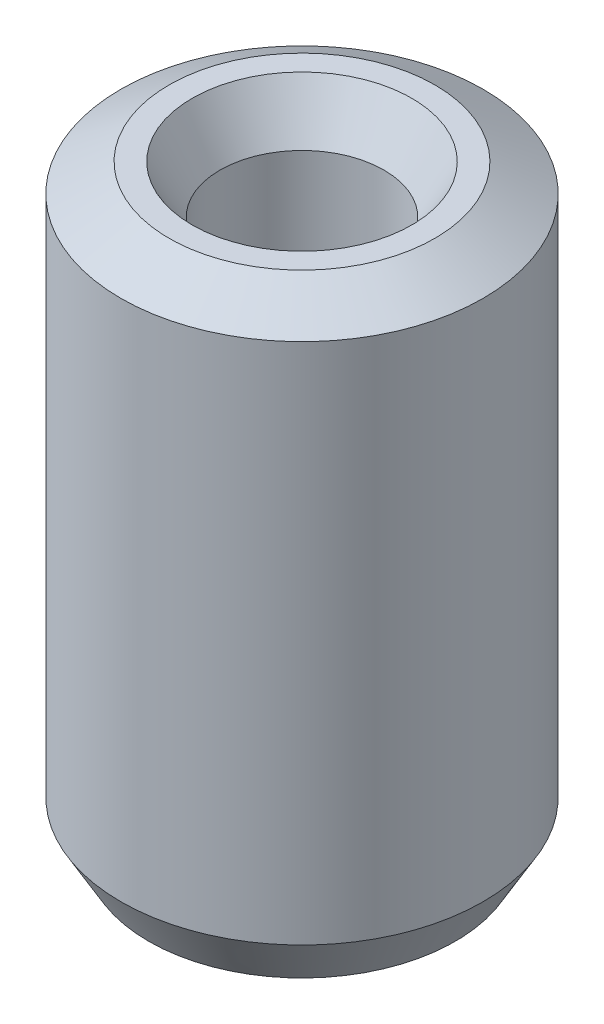
ISO-10303-21;
HEADER;
FILE_DESCRIPTION(('STEP AP214'),'2;1');
FILE_NAME('part.step','',(''),(''),'','','');
FILE_SCHEMA(('AUTOMOTIVE_DESIGN { 1 0 10303 214 1 1 1 1 }'));
ENDSEC;
DATA;
#1=APPLICATION_CONTEXT('core data for automotive mechanical design processes');
#2=APPLICATION_PROTOCOL_DEFINITION('international standard','automotive_design',2000,#1);
#3=PRODUCT_CONTEXT('',#1,'mechanical');
#4=PRODUCT('Part','Part','',(#3));
#5=PRODUCT_RELATED_PRODUCT_CATEGORY('part','',(#4));
#6=PRODUCT_DEFINITION_FORMATION('','',#4);
#7=PRODUCT_DEFINITION_CONTEXT('part definition',#1,'design');
#8=PRODUCT_DEFINITION('design','',#6,#7);
#9=PRODUCT_DEFINITION_SHAPE('','',#8);
#10=(LENGTH_UNIT() NAMED_UNIT(*) SI_UNIT(.MILLI.,.METRE.));
#11=(NAMED_UNIT(*) PLANE_ANGLE_UNIT() SI_UNIT($,.RADIAN.));
#12=(NAMED_UNIT(*) SI_UNIT($,.STERADIAN.) SOLID_ANGLE_UNIT());
#13=UNCERTAINTY_MEASURE_WITH_UNIT(LENGTH_MEASURE(1.E-05),#10,'distance_accuracy_value','');
#14=(GEOMETRIC_REPRESENTATION_CONTEXT(3) GLOBAL_UNCERTAINTY_ASSIGNED_CONTEXT((#13)) GLOBAL_UNIT_ASSIGNED_CONTEXT((#10,
#11,#12)) REPRESENTATION_CONTEXT('',''));
#15=CARTESIAN_POINT('',(0.,0.,0.));
#16=DIRECTION('',(0.,0.,1.));
#17=DIRECTION('',(1.,0.,0.));
#18=AXIS2_PLACEMENT_3D('',#15,#16,#17);
#19=CARTESIAN_POINT('',(0.,57.8312941329727,0.));
#20=DIRECTION('',(0.,-1.,0.));
#21=DIRECTION('',(0.,0.,-1.));
#22=AXIS2_PLACEMENT_3D('',#19,#20,#21);
#23=CYLINDRICAL_SURFACE('',#22,17.5);
#24=CARTESIAN_POINT('',(0.,4.65961195969248,0.));
#25=DIRECTION('',(0.,1.,0.));
#26=DIRECTION('',(0.,0.,1.));
#27=AXIS2_PLACEMENT_3D('',#24,#25,#26);
#28=CIRCLE('',#27,17.5);
#29=CARTESIAN_POINT('',(0.,4.65961195969247,-17.5));
#30=VERTEX_POINT('',#29);
#31=EDGE_CURVE('E10',#30,#30,#28,.T.);
#32=CARTESIAN_POINT('',(0.,55.1410659137251,0.));
#33=DIRECTION('',(0.,1.,0.));
#34=DIRECTION('',(0.,0.,1.));
#35=AXIS2_PLACEMENT_3D('',#32,#33,#34);
#36=CIRCLE('',#35,17.5);
#37=CARTESIAN_POINT('',(0.,55.1410659137251,-17.5));
#38=VERTEX_POINT('',#37);
#39=EDGE_CURVE('E50',#38,#38,#36,.F.);
#40=CARTESIAN_POINT('',(0.,4.65961195969247,-17.5));
#41=CARTESIAN_POINT('',(0.,5.18546043838031,-17.5));
#42=CARTESIAN_POINT('',(0.,5.71130891706815,-17.5));
#43=CARTESIAN_POINT('',(0.,6.76300587444383,-17.5));
#44=CARTESIAN_POINT('',(0.,7.28885435313167,-17.5));
#45=CARTESIAN_POINT('',(0.,8.34055131050735,-17.5));
#46=CARTESIAN_POINT('',(0.,8.86639978919519,-17.5));
#47=CARTESIAN_POINT('',(0.,9.91809674657087,-17.5));
#48=CARTESIAN_POINT('',(0.,10.4439452252587,-17.5));
#49=CARTESIAN_POINT('',(0.,11.4956421826344,-17.5));
#50=CARTESIAN_POINT('',(0.,12.0214906613222,-17.5));
#51=CARTESIAN_POINT('',(0.,13.0731876186979,-17.5));
#52=CARTESIAN_POINT('',(0.,13.5990360973857,-17.5));
#53=CARTESIAN_POINT('',(0.,14.6507330547614,-17.5));
#54=CARTESIAN_POINT('',(0.,15.1765815334493,-17.5));
#55=CARTESIAN_POINT('',(0.,16.2282784908249,-17.5));
#56=CARTESIAN_POINT('',(0.,16.7541269695128,-17.5));
#57=CARTESIAN_POINT('',(0.,17.8058239268885,-17.5));
#58=CARTESIAN_POINT('',(0.,18.3316724055763,-17.5));
#59=CARTESIAN_POINT('',(0.,19.383369362952,-17.5));
#60=CARTESIAN_POINT('',(0.,19.9092178416398,-17.5));
#61=CARTESIAN_POINT('',(0.,20.9609147990155,-17.5));
#62=CARTESIAN_POINT('',(0.,21.4867632777033,-17.5));
#63=CARTESIAN_POINT('',(0.,22.538460235079,-17.5));
#64=CARTESIAN_POINT('',(0.,23.0643087137669,-17.5));
#65=CARTESIAN_POINT('',(0.,24.1160056711425,-17.5));
#66=CARTESIAN_POINT('',(0.,24.6418541498304,-17.5));
#67=CARTESIAN_POINT('',(0.,25.693551107206,-17.5));
#68=CARTESIAN_POINT('',(0.,26.2193995858939,-17.5));
#69=CARTESIAN_POINT('',(0.,27.2710965432696,-17.5));
#70=CARTESIAN_POINT('',(0.,27.7969450219574,-17.5));
#71=CARTESIAN_POINT('',(0.,28.8486419793331,-17.5));
#72=CARTESIAN_POINT('',(0.,29.3744904580209,-17.5));
#73=CARTESIAN_POINT('',(0.,30.4261874153966,-17.5));
#74=CARTESIAN_POINT('',(0.,30.9520358940844,-17.5));
#75=CARTESIAN_POINT('',(0.,32.0037328514601,-17.5));
#76=CARTESIAN_POINT('',(0.,32.529581330148,-17.5));
#77=CARTESIAN_POINT('',(0.,33.5812782875236,-17.5));
#78=CARTESIAN_POINT('',(0.,34.1071267662115,-17.5));
#79=CARTESIAN_POINT('',(0.,35.1588237235872,-17.5));
#80=CARTESIAN_POINT('',(0.,35.684672202275,-17.5));
#81=CARTESIAN_POINT('',(0.,36.7363691596507,-17.5));
#82=CARTESIAN_POINT('',(0.,37.2622176383385,-17.5));
#83=CARTESIAN_POINT('',(0.,38.3139145957142,-17.5));
#84=CARTESIAN_POINT('',(0.,38.839763074402,-17.5));
#85=CARTESIAN_POINT('',(0.,39.8914600317777,-17.5));
#86=CARTESIAN_POINT('',(0.,40.4173085104656,-17.5));
#87=CARTESIAN_POINT('',(0.,41.4690054678412,-17.5));
#88=CARTESIAN_POINT('',(0.,41.9948539465291,-17.5));
#89=CARTESIAN_POINT('',(0.,43.0465509039047,-17.5));
#90=CARTESIAN_POINT('',(0.,43.5723993825926,-17.5));
#91=CARTESIAN_POINT('',(0.,44.6240963399683,-17.5));
#92=CARTESIAN_POINT('',(0.,45.1499448186561,-17.5));
#93=CARTESIAN_POINT('',(0.,46.2016417760318,-17.5));
#94=CARTESIAN_POINT('',(0.,46.7274902547196,-17.5));
#95=CARTESIAN_POINT('',(0.,47.7791872120953,-17.5));
#96=CARTESIAN_POINT('',(0.,48.3050356907831,-17.5));
#97=CARTESIAN_POINT('',(0.,49.3567326481588,-17.5));
#98=CARTESIAN_POINT('',(0.,49.8825811268467,-17.5));
#99=CARTESIAN_POINT('',(0.,50.9342780842223,-17.5));
#100=CARTESIAN_POINT('',(0.,51.4601265629102,-17.5));
#101=CARTESIAN_POINT('',(0.,52.5118235202859,-17.5));
#102=CARTESIAN_POINT('',(0.,53.0376719989737,-17.5));
#103=CARTESIAN_POINT('',(0.,54.0893689563494,-17.5));
#104=CARTESIAN_POINT('',(0.,54.6152174350372,-17.5));
#105=CARTESIAN_POINT('',(0.,55.1410659137251,-17.5));
#106=B_SPLINE_CURVE_WITH_KNOTS('',3,(#40,#41,#42,#43,#44,#45,#46,#47,#48,#49,#50,#51,#52,#53,
#54,#55,#56,#57,#58,#59,#60,#61,#62,#63,#64,#65,#66,#67,#68,#69,#70,#71,#72,#73,#74,#75,#76,#77,
#78,#79,#80,#81,#82,#83,#84,#85,#86,#87,#88,#89,#90,#91,#92,#93,#94,#95,#96,#97,#98,#99,#100,
#101,#102,#103,#104,#105),.UNSPECIFIED.,.F.,.F.,(4,2,2,2,2,2,2,2,2,2,2,2,2,2,2,2,2,2,2,2,2,2,2,
2,2,2,2,2,2,2,2,2,4),(0.,1.57754543606352,3.15509087212704,4.73263630819056,6.31018174425407,
7.88772718031759,9.46527261638111,11.0428180524446,12.6203634885081,14.1979089245717,
15.7754543606352,17.3529997966987,18.9305452327622,20.5080906688257,22.0856361048893,
23.6631815409528,25.2407269770163,26.8182724130798,28.3958178491433,29.9733632852068,
31.5509087212704,33.1284541573339,34.7059995933974,36.2835450294609,37.8610904655244,
39.438635901588,41.0161813376515,42.593726773715,44.1712722097785,45.748817645842,
47.3263630819055,48.9039085179691,50.4814539540326),.UNSPECIFIED.);
#107=EDGE_CURVE('BSEAM39',#30,#38,#106,.T.);
#108=ORIENTED_EDGE('',*,*,#31,.T.);
#109=ORIENTED_EDGE('',*,*,#39,.T.);
#110=ORIENTED_EDGE('',*,*,#107,.T.);
#111=ORIENTED_EDGE('',*,*,#107,.F.);
#112=EDGE_LOOP('',(#108,#110,#109,#111));
#113=FACE_BOUND('',#112,.T.);
#114=ADVANCED_FACE('F39',(#113),#23,.T.);
#115=CARTESIAN_POINT('',(0.,57.8312941329727,0.));
#116=DIRECTION('',(0.,1.,0.));
#117=DIRECTION('',(0.,0.,1.));
#118=AXIS2_PLACEMENT_3D('',#115,#116,#117);
#119=PLANE('',#118);
#120=CARTESIAN_POINT('',(0.,57.8312941329727,0.));
#121=DIRECTION('',(0.,1.,0.));
#122=DIRECTION('',(0.,0.,1.));
#123=AXIS2_PLACEMENT_3D('',#120,#121,#122);
#124=CIRCLE('',#123,10.6077309006482);
#125=CARTESIAN_POINT('',(0.,57.8312941329727,10.6077309006482));
#126=VERTEX_POINT('',#125);
#127=EDGE_CURVE('E58',#126,#126,#124,.F.);
#128=ORIENTED_EDGE('',*,*,#127,.T.);
#129=EDGE_LOOP('',(#128));
#130=FACE_BOUND('',#129,.T.);
#131=CARTESIAN_POINT('',(0.,57.8312941329727,0.));
#132=DIRECTION('',(0.,1.,0.));
#133=DIRECTION('',(0.,0.,1.));
#134=AXIS2_PLACEMENT_3D('',#131,#132,#133);
#135=CIRCLE('',#134,12.8403880403077);
#136=CARTESIAN_POINT('',(0.,57.8312941329727,-12.8403880403077));
#137=VERTEX_POINT('',#136);
#138=EDGE_CURVE('E61',#137,#137,#135,.T.);
#139=ORIENTED_EDGE('',*,*,#138,.T.);
#140=EDGE_LOOP('',(#139));
#141=FACE_BOUND('',#140,.T.);
#142=ADVANCED_FACE('F88',(#130,#141),#119,.T.);
#143=CARTESIAN_POINT('',(0.,0.,0.));
#144=DIRECTION('',(0.,1.,0.));
#145=DIRECTION('',(0.,0.,1.));
#146=AXIS2_PLACEMENT_3D('',#143,#144,#145);
#147=PLANE('',#146);
#148=CARTESIAN_POINT('',(0.,0.,0.));
#149=DIRECTION('',(0.,1.,0.));
#150=DIRECTION('',(0.,0.,1.));
#151=AXIS2_PLACEMENT_3D('',#148,#149,#150);
#152=CIRCLE('',#151,12.5771146410929);
#153=CARTESIAN_POINT('',(0.,0.,-12.5771146410929));
#154=VERTEX_POINT('',#153);
#155=EDGE_CURVE('E51',#154,#154,#152,.T.);
#156=ORIENTED_EDGE('',*,*,#155,.T.);
#157=EDGE_LOOP('',(#156));
#158=FACE_BOUND('',#157,.T.);
#159=CARTESIAN_POINT('',(0.,0.,0.));
#160=DIRECTION('',(0.,1.,0.));
#161=DIRECTION('',(0.,0.,1.));
#162=AXIS2_PLACEMENT_3D('',#159,#160,#161);
#163=CIRCLE('',#162,14.8097717807523);
#164=CARTESIAN_POINT('',(0.,0.,14.8097717807523));
#165=VERTEX_POINT('',#164);
#166=EDGE_CURVE('E54',#165,#165,#163,.F.);
#167=ORIENTED_EDGE('',*,*,#166,.T.);
#168=EDGE_LOOP('',(#167));
#169=FACE_BOUND('',#168,.T.);
#170=ADVANCED_FACE('F83',(#158,#169),#147,.F.);
#171=CARTESIAN_POINT('',(0.,57.8312941329727,0.));
#172=DIRECTION('',(0.,-1.,0.));
#173=DIRECTION('',(0.,0.,-1.));
#174=AXIS2_PLACEMENT_3D('',#171,#172,#173);
#175=CYLINDRICAL_SURFACE('',#174,7.91750268140053);
#176=CARTESIAN_POINT('',(0.,53.1716821732802,0.));
#177=DIRECTION('',(0.,1.,0.));
#178=DIRECTION('',(0.,0.,1.));
#179=AXIS2_PLACEMENT_3D('',#176,#177,#178);
#180=CIRCLE('',#179,7.91750268140053);
#181=CARTESIAN_POINT('',(0.,53.1716821732801,-7.91750268140053));
#182=VERTEX_POINT('',#181);
#183=EDGE_CURVE('E67',#182,#182,#180,.T.);
#184=CARTESIAN_POINT('',(0.,2.6902282192476,0.));
#185=DIRECTION('',(0.,1.,0.));
#186=DIRECTION('',(0.,0.,1.));
#187=AXIS2_PLACEMENT_3D('',#184,#185,#186);
#188=CIRCLE('',#187,7.91750268140053);
#189=CARTESIAN_POINT('',(0.,2.6902282192476,-7.91750268140053));
#190=VERTEX_POINT('',#189);
#191=EDGE_CURVE('E69',#190,#190,#188,.F.);
#192=CARTESIAN_POINT('',(0.,53.1716821732801,-7.91750268140053));
#193=CARTESIAN_POINT('',(0.,52.6458336945923,-7.91750268140053));
#194=CARTESIAN_POINT('',(0.,52.1199852159045,-7.91750268140053));
#195=CARTESIAN_POINT('',(0.,51.0682882585288,-7.91750268140053));
#196=CARTESIAN_POINT('',(0.,50.542439779841,-7.91750268140053));
#197=CARTESIAN_POINT('',(0.,49.4907428224653,-7.91750268140053));
#198=CARTESIAN_POINT('',(0.,48.9648943437774,-7.91750268140053));
#199=CARTESIAN_POINT('',(0.,47.9131973864018,-7.91750268140053));
#200=CARTESIAN_POINT('',(0.,47.3873489077139,-7.91750268140053));
#201=CARTESIAN_POINT('',(0.,46.3356519503382,-7.91750268140053));
#202=CARTESIAN_POINT('',(0.,45.8098034716504,-7.91750268140053));
#203=CARTESIAN_POINT('',(0.,44.7581065142747,-7.91750268140053));
#204=CARTESIAN_POINT('',(0.,44.2322580355869,-7.91750268140053));
#205=CARTESIAN_POINT('',(0.,43.1805610782112,-7.91750268140053));
#206=CARTESIAN_POINT('',(0.,42.6547125995234,-7.91750268140053));
#207=CARTESIAN_POINT('',(0.,41.6030156421477,-7.91750268140053));
#208=CARTESIAN_POINT('',(0.,41.0771671634598,-7.91750268140053));
#209=CARTESIAN_POINT('',(0.,40.0254702060842,-7.91750268140053));
#210=CARTESIAN_POINT('',(0.,39.4996217273963,-7.91750268140053));
#211=CARTESIAN_POINT('',(0.,38.4479247700206,-7.91750268140053));
#212=CARTESIAN_POINT('',(0.,37.9220762913328,-7.91750268140053));
#213=CARTESIAN_POINT('',(0.,36.8703793339571,-7.91750268140053));
#214=CARTESIAN_POINT('',(0.,36.3445308552693,-7.91750268140053));
#215=CARTESIAN_POINT('',(0.,35.2928338978936,-7.91750268140053));
#216=CARTESIAN_POINT('',(0.,34.7669854192058,-7.91750268140053));
#217=CARTESIAN_POINT('',(0.,33.7152884618301,-7.91750268140053));
#218=CARTESIAN_POINT('',(0.,33.1894399831423,-7.91750268140053));
#219=CARTESIAN_POINT('',(0.,32.1377430257666,-7.91750268140053));
#220=CARTESIAN_POINT('',(0.,31.6118945470787,-7.91750268140053));
#221=CARTESIAN_POINT('',(0.,30.5601975897031,-7.91750268140053));
#222=CARTESIAN_POINT('',(0.,30.0343491110152,-7.91750268140053));
#223=CARTESIAN_POINT('',(0.,28.9826521536395,-7.91750268140053));
#224=CARTESIAN_POINT('',(0.,28.4568036749517,-7.91750268140053));
#225=CARTESIAN_POINT('',(0.,27.405106717576,-7.91750268140053));
#226=CARTESIAN_POINT('',(0.,26.8792582388882,-7.91750268140053));
#227=CARTESIAN_POINT('',(0.,25.8275612815125,-7.91750268140053));
#228=CARTESIAN_POINT('',(0.,25.3017128028247,-7.91750268140053));
#229=CARTESIAN_POINT('',(0.,24.250015845449,-7.91750268140053));
#230=CARTESIAN_POINT('',(0.,23.7241673667612,-7.91750268140053));
#231=CARTESIAN_POINT('',(0.,22.6724704093855,-7.91750268140053));
#232=CARTESIAN_POINT('',(0.,22.1466219306976,-7.91750268140053));
#233=CARTESIAN_POINT('',(0.,21.094924973322,-7.91750268140053));
#234=CARTESIAN_POINT('',(0.,20.5690764946341,-7.91750268140053));
#235=CARTESIAN_POINT('',(0.,19.5173795372584,-7.91750268140053));
#236=CARTESIAN_POINT('',(0.,18.9915310585706,-7.91750268140053));
#237=CARTESIAN_POINT('',(0.,17.9398341011949,-7.91750268140053));
#238=CARTESIAN_POINT('',(0.,17.4139856225071,-7.91750268140053));
#239=CARTESIAN_POINT('',(0.,16.3622886651314,-7.91750268140053));
#240=CARTESIAN_POINT('',(0.,15.8364401864436,-7.91750268140053));
#241=CARTESIAN_POINT('',(0.,14.7847432290679,-7.91750268140053));
#242=CARTESIAN_POINT('',(0.,14.2588947503801,-7.91750268140053));
#243=CARTESIAN_POINT('',(0.,13.2071977930044,-7.91750268140053));
#244=CARTESIAN_POINT('',(0.,12.6813493143165,-7.91750268140053));
#245=CARTESIAN_POINT('',(0.,11.6296523569409,-7.91750268140053));
#246=CARTESIAN_POINT('',(0.,11.103803878253,-7.91750268140053));
#247=CARTESIAN_POINT('',(0.,10.0521069208773,-7.91750268140053));
#248=CARTESIAN_POINT('',(0.,9.5262584421895,-7.91750268140053));
#249=CARTESIAN_POINT('',(0.,8.47456148481383,-7.91750268140053));
#250=CARTESIAN_POINT('',(0.,7.94871300612599,-7.91750268140053));
#251=CARTESIAN_POINT('',(0.,6.89701604875031,-7.91750268140053));
#252=CARTESIAN_POINT('',(0.,6.37116757006247,-7.91750268140053));
#253=CARTESIAN_POINT('',(0.,5.31947061268679,-7.91750268140053));
#254=CARTESIAN_POINT('',(0.,4.79362213399895,-7.91750268140053));
#255=CARTESIAN_POINT('',(0.,3.74192517662327,-7.91750268140053));
#256=CARTESIAN_POINT('',(0.,3.21607669793543,-7.91750268140053));
#257=CARTESIAN_POINT('',(0.,2.6902282192476,-7.91750268140053));
#258=B_SPLINE_CURVE_WITH_KNOTS('',3,(#192,#193,#194,#195,#196,#197,#198,#199,#200,#201,#202,
#203,#204,#205,#206,#207,#208,#209,#210,#211,#212,#213,#214,#215,#216,#217,#218,#219,#220,#221,
#222,#223,#224,#225,#226,#227,#228,#229,#230,#231,#232,#233,#234,#235,#236,#237,#238,#239,#240,
#241,#242,#243,#244,#245,#246,#247,#248,#249,#250,#251,#252,#253,#254,#255,#256,#257),
.UNSPECIFIED.,.F.,.F.,(4,2,2,2,2,2,2,2,2,2,2,2,2,2,2,2,2,2,2,2,2,2,2,2,2,2,2,2,2,2,2,2,4),(0.,
1.57754543606351,3.15509087212703,4.73263630819055,6.31018174425407,7.88772718031758,
9.4652726163811,11.0428180524446,12.6203634885081,14.1979089245717,15.7754543606352,
17.3529997966987,18.9305452327622,20.5080906688257,22.0856361048892,23.6631815409528,
25.2407269770163,26.8182724130798,28.3958178491433,29.9733632852068,31.5509087212703,
33.1284541573339,34.7059995933974,36.2835450294609,37.8610904655244,39.4386359015879,
41.0161813376514,42.593726773715,44.1712722097785,45.748817645842,47.3263630819055,
48.903908517969,50.4814539540326),.UNSPECIFIED.);
#259=EDGE_CURVE('BSEAM71',#182,#190,#258,.T.);
#260=ORIENTED_EDGE('',*,*,#183,.T.);
#261=ORIENTED_EDGE('',*,*,#191,.T.);
#262=ORIENTED_EDGE('',*,*,#259,.T.);
#263=ORIENTED_EDGE('',*,*,#259,.F.);
#264=EDGE_LOOP('',(#260,#262,#261,#263));
#265=FACE_BOUND('',#264,.T.);
#266=ADVANCED_FACE('F71',(#265),#175,.F.);
#267=CARTESIAN_POINT('',(0.,53.1716821732802,0.));
#268=DIRECTION('',(0.,1.,0.));
#269=DIRECTION('',(0.,0.,1.));
#270=AXIS2_PLACEMENT_3D('',#267,#268,#269);
#271=CONICAL_SURFACE('',#270,7.91750268140053,0.523598775598301);
#272=ORIENTED_EDGE('',*,*,#127,.F.);
#273=EDGE_LOOP('',(#272));
#274=FACE_BOUND('',#273,.T.);
#275=ORIENTED_EDGE('',*,*,#183,.F.);
#276=EDGE_LOOP('',(#275));
#277=FACE_BOUND('',#276,.T.);
#278=ADVANCED_FACE('F77',(#274,#277),#271,.F.);
#279=CARTESIAN_POINT('',(0.,0.,0.));
#280=DIRECTION('',(0.,-1.,0.));
#281=DIRECTION('',(0.,0.,-1.));
#282=AXIS2_PLACEMENT_3D('',#279,#280,#281);
#283=CONICAL_SURFACE('',#282,12.5771146410929,1.04719755119659);
#284=CARTESIAN_POINT('',(0.,2.6902282192476,-7.91750268140053));
#285=CARTESIAN_POINT('',(0.,2.66220500863044,-7.96604030598066));
#286=CARTESIAN_POINT('',(0.,2.63418179801328,-8.01457793056079));
#287=CARTESIAN_POINT('',(0.,2.57813537677895,-8.11165317972105));
#288=CARTESIAN_POINT('',(0.,2.55011216616179,-8.16019080430118));
#289=CARTESIAN_POINT('',(0.,2.49406574492746,-8.25726605346143));
#290=CARTESIAN_POINT('',(0.,2.4660425343103,-8.30580367804156));
#291=CARTESIAN_POINT('',(0.,2.40999611307598,-8.40287892720182));
#292=CARTESIAN_POINT('',(0.,2.38197290245881,-8.45141655178195));
#293=CARTESIAN_POINT('',(0.,2.32592648122449,-8.54849180094221));
#294=CARTESIAN_POINT('',(0.,2.29790327060733,-8.59702942552233));
#295=CARTESIAN_POINT('',(0.,2.241856849373,-8.69410467468259));
#296=CARTESIAN_POINT('',(0.,2.21383363875584,-8.74264229926272));
#297=CARTESIAN_POINT('',(0.,2.15778721752151,-8.83971754842298));
#298=CARTESIAN_POINT('',(0.,2.12976400690435,-8.88825517300311));
#299=CARTESIAN_POINT('',(0.,2.07371758567003,-8.98533042216336));
#300=CARTESIAN_POINT('',(0.,2.04569437505286,-9.03386804674349));
#301=CARTESIAN_POINT('',(0.,1.98964795381854,-9.13094329590375));
#302=CARTESIAN_POINT('',(0.,1.96162474320138,-9.17948092048388));
#303=CARTESIAN_POINT('',(0.,1.90557832196705,-9.27655616964414));
#304=CARTESIAN_POINT('',(0.,1.87755511134989,-9.32509379422426));
#305=CARTESIAN_POINT('',(0.,1.82150869011556,-9.42216904338452));
#306=CARTESIAN_POINT('',(0.,1.7934854794984,-9.47070666796465));
#307=CARTESIAN_POINT('',(0.,1.73743905826408,-9.56778191712491));
#308=CARTESIAN_POINT('',(0.,1.70941584764691,-9.61631954170504));
#309=CARTESIAN_POINT('',(0.,1.65336942641259,-9.71339479086529));
#310=CARTESIAN_POINT('',(0.,1.62534621579543,-9.76193241544542));
#311=CARTESIAN_POINT('',(0.,1.5692997945611,-9.85900766460568));
#312=CARTESIAN_POINT('',(0.,1.54127658394394,-9.90754528918581));
#313=CARTESIAN_POINT('',(0.,1.48523016270961,-10.0046205383461));
#314=CARTESIAN_POINT('',(0.,1.45720695209245,-10.0531581629262));
#315=CARTESIAN_POINT('',(0.,1.40116053085813,-10.1502334120865));
#316=CARTESIAN_POINT('',(0.,1.37313732024096,-10.1987710366666));
#317=CARTESIAN_POINT('',(0.,1.31709089900664,-10.2958462858268));
#318=CARTESIAN_POINT('',(0.,1.28906768838948,-10.344383910407));
#319=CARTESIAN_POINT('',(0.,1.23302126715515,-10.4414591595672));
#320=CARTESIAN_POINT('',(0.,1.20499805653799,-10.4899967841474));
#321=CARTESIAN_POINT('',(0.,1.14895163530366,-10.5870720333076));
#322=CARTESIAN_POINT('',(0.,1.1209284246865,-10.6356096578877));
#323=CARTESIAN_POINT('',(0.,1.06488200345218,-10.732684907048));
#324=CARTESIAN_POINT('',(0.,1.03685879283501,-10.7812225316281));
#325=CARTESIAN_POINT('',(0.,0.980812371600688,-10.8782977807884));
#326=CARTESIAN_POINT('',(0.,0.952789160983526,-10.9268354053685));
#327=CARTESIAN_POINT('',(0.,0.896742739749201,-11.0239106545288));
#328=CARTESIAN_POINT('',(0.,0.868719529132038,-11.0724482791089));
#329=CARTESIAN_POINT('',(0.,0.812673107897713,-11.1695235282692));
#330=CARTESIAN_POINT('',(0.,0.784649897280551,-11.2180611528493));
#331=CARTESIAN_POINT('',(0.,0.728603476046226,-11.3151364020095));
#332=CARTESIAN_POINT('',(0.,0.700580265429063,-11.3636740265897));
#333=CARTESIAN_POINT('',(0.,0.644533844194738,-11.4607492757499));
#334=CARTESIAN_POINT('',(0.,0.616510633577575,-11.5092869003301));
#335=CARTESIAN_POINT('',(0.,0.56046421234325,-11.6063621494903));
#336=CARTESIAN_POINT('',(0.,0.532441001726088,-11.6548997740704));
#337=CARTESIAN_POINT('',(0.,0.476394580491763,-11.7519750232307));
#338=CARTESIAN_POINT('',(0.,0.4483713698746,-11.8005126478108));
#339=CARTESIAN_POINT('',(0.,0.392324948640275,-11.8975878969711));
#340=CARTESIAN_POINT('',(0.,0.364301738023113,-11.9461255215512));
#341=CARTESIAN_POINT('',(0.,0.308255316788788,-12.0432007707115));
#342=CARTESIAN_POINT('',(0.,0.280232106171625,-12.0917383952916));
#343=CARTESIAN_POINT('',(0.,0.2241856849373,-12.1888136444519));
#344=CARTESIAN_POINT('',(0.,0.196162474320138,-12.237351269032));
#345=CARTESIAN_POINT('',(0.,0.140116053085813,-12.3344265181922));
#346=CARTESIAN_POINT('',(0.,0.11209284246865,-12.3829641427724));
#347=CARTESIAN_POINT('',(0.,0.0560464212343251,-12.4800393919326));
#348=CARTESIAN_POINT('',(0.,0.0280232106171625,-12.5285770165128));
#349=CARTESIAN_POINT('',(0.,0.,-12.5771146410929));
#350=B_SPLINE_CURVE_WITH_KNOTS('',3,(#284,#285,#286,#287,#288,#289,#290,#291,#292,#293,#294,
#295,#296,#297,#298,#299,#300,#301,#302,#303,#304,#305,#306,#307,#308,#309,#310,#311,#312,#313,
#314,#315,#316,#317,#318,#319,#320,#321,#322,#323,#324,#325,#326,#327,#328,#329,#330,#331,#332,
#333,#334,#335,#336,#337,#338,#339,#340,#341,#342,#343,#344,#345,#346,#347,#348,#349),
.UNSPECIFIED.,.F.,.F.,(4,2,2,2,2,2,2,2,2,2,2,2,2,2,2,2,2,2,2,2,2,2,2,2,2,2,2,2,2,2,2,2,4),(0.,
0.168139263702974,0.336278527405947,0.504417791108921,0.672557054811896,0.840696318514871,
1.00883558221784,1.17697484592082,1.34511410962379,1.51325337332677,1.68139263702974,
1.84953190073271,2.01767116443569,2.18581042813866,2.35394969184164,2.52208895554461,
2.69022821924758,2.85836748295056,3.02650674665353,3.19464601035651,3.36278527405948,
3.53092453776245,3.69906380146543,3.8672030651684,4.03534232887138,4.20348159257435,
4.37162085627733,4.5397601199803,4.70789938368327,4.87603864738625,5.04417791108922,
5.2123171747922,5.38045643849517),.UNSPECIFIED.);
#351=EDGE_CURVE('BSEAM73',#190,#154,#350,.T.);
#352=ORIENTED_EDGE('',*,*,#191,.F.);
#353=ORIENTED_EDGE('',*,*,#155,.F.);
#354=ORIENTED_EDGE('',*,*,#351,.T.);
#355=ORIENTED_EDGE('',*,*,#351,.F.);
#356=EDGE_LOOP('',(#352,#354,#353,#355));
#357=FACE_BOUND('',#356,.T.);
#358=ADVANCED_FACE('F73',(#357),#283,.F.);
#359=CARTESIAN_POINT('',(0.,4.65961195969248,0.));
#360=DIRECTION('',(0.,1.,0.));
#361=DIRECTION('',(0.,0.,1.));
#362=AXIS2_PLACEMENT_3D('',#359,#360,#361);
#363=CONICAL_SURFACE('',#362,17.5,0.523598775598303);
#364=ORIENTED_EDGE('',*,*,#166,.F.);
#365=EDGE_LOOP('',(#364));
#366=FACE_BOUND('',#365,.T.);
#367=ORIENTED_EDGE('',*,*,#31,.F.);
#368=EDGE_LOOP('',(#367));
#369=FACE_BOUND('',#368,.T.);
#370=ADVANCED_FACE('F76',(#366,#369),#363,.T.);
#371=CARTESIAN_POINT('',(0.,57.8312941329727,0.));
#372=DIRECTION('',(0.,-1.,0.));
#373=DIRECTION('',(0.,0.,-1.));
#374=AXIS2_PLACEMENT_3D('',#371,#372,#373);
#375=CONICAL_SURFACE('',#374,12.8403880403077,1.04719755119659);
#376=CARTESIAN_POINT('',(0.,55.1410659137251,-17.5));
#377=CARTESIAN_POINT('',(0.,55.1690891243422,-17.4514623754199));
#378=CARTESIAN_POINT('',(0.,55.1971123349594,-17.4029247508398));
#379=CARTESIAN_POINT('',(0.,55.2531587561937,-17.3058495016795));
#380=CARTESIAN_POINT('',(0.,55.2811819668109,-17.2573118770994));
#381=CARTESIAN_POINT('',(0.,55.3372283880452,-17.1602366279391));
#382=CARTESIAN_POINT('',(0.,55.3652515986624,-17.111699003359));
#383=CARTESIAN_POINT('',(0.,55.4212980198967,-17.0146237541987));
#384=CARTESIAN_POINT('',(0.,55.4493212305138,-16.9660861296186));
#385=CARTESIAN_POINT('',(0.,55.5053676517482,-16.8690108804583));
#386=CARTESIAN_POINT('',(0.,55.5333908623653,-16.8204732558782));
#387=CARTESIAN_POINT('',(0.,55.5894372835997,-16.723398006718));
#388=CARTESIAN_POINT('',(0.,55.6174604942168,-16.6748603821378));
#389=CARTESIAN_POINT('',(0.,55.6735069154511,-16.5777851329776));
#390=CARTESIAN_POINT('',(0.,55.7015301260683,-16.5292475083974));
#391=CARTESIAN_POINT('',(0.,55.7575765473026,-16.4321722592372));
#392=CARTESIAN_POINT('',(0.,55.7855997579198,-16.3836346346571));
#393=CARTESIAN_POINT('',(0.,55.8416461791541,-16.2865593854968));
#394=CARTESIAN_POINT('',(0.,55.8696693897713,-16.2380217609167));
#395=CARTESIAN_POINT('',(0.,55.9257158110056,-16.1409465117564));
#396=CARTESIAN_POINT('',(0.,55.9537390216228,-16.0924088871763));
#397=CARTESIAN_POINT('',(0.,56.0097854428571,-15.995333638016));
#398=CARTESIAN_POINT('',(0.,56.0378086534743,-15.9467960134359));
#399=CARTESIAN_POINT('',(0.,56.0938550747086,-15.8497207642756));
#400=CARTESIAN_POINT('',(0.,56.1218782853257,-15.8011831396955));
#401=CARTESIAN_POINT('',(0.,56.1779247065601,-15.7041078905353));
#402=CARTESIAN_POINT('',(0.,56.2059479171772,-15.6555702659551));
#403=CARTESIAN_POINT('',(0.,56.2619943384116,-15.5584950167949));
#404=CARTESIAN_POINT('',(0.,56.2900175490287,-15.5099573922147));
#405=CARTESIAN_POINT('',(0.,56.346063970263,-15.4128821430545));
#406=CARTESIAN_POINT('',(0.,56.3740871808802,-15.3643445184744));
#407=CARTESIAN_POINT('',(0.,56.4301336021145,-15.2672692693141));
#408=CARTESIAN_POINT('',(0.,56.4581568127317,-15.218731644734));
#409=CARTESIAN_POINT('',(0.,56.514203233966,-15.1216563955737));
#410=CARTESIAN_POINT('',(0.,56.5422264445832,-15.0731187709936));
#411=CARTESIAN_POINT('',(0.,56.5982728658175,-14.9760435218333));
#412=CARTESIAN_POINT('',(0.,56.6262960764347,-14.9275058972532));
#413=CARTESIAN_POINT('',(0.,56.682342497669,-14.8304306480929));
#414=CARTESIAN_POINT('',(0.,56.7103657082861,-14.7818930235128));
#415=CARTESIAN_POINT('',(0.,56.7664121295205,-14.6848177743526));
#416=CARTESIAN_POINT('',(0.,56.7944353401376,-14.6362801497724));
#417=CARTESIAN_POINT('',(0.,56.850481761372,-14.5392049006122));
#418=CARTESIAN_POINT('',(0.,56.8785049719891,-14.490667276032));
#419=CARTESIAN_POINT('',(0.,56.9345513932235,-14.3935920268718));
#420=CARTESIAN_POINT('',(0.,56.9625746038406,-14.3450544022917));
#421=CARTESIAN_POINT('',(0.,57.0186210250749,-14.2479791531314));
#422=CARTESIAN_POINT('',(0.,57.0466442356921,-14.1994415285513));
#423=CARTESIAN_POINT('',(0.,57.1026906569264,-14.102366279391));
#424=CARTESIAN_POINT('',(0.,57.1307138675436,-14.0538286548109));
#425=CARTESIAN_POINT('',(0.,57.1867602887779,-13.9567534056506));
#426=CARTESIAN_POINT('',(0.,57.2147834993951,-13.9082157810705));
#427=CARTESIAN_POINT('',(0.,57.2708299206294,-13.8111405319102));
#428=CARTESIAN_POINT('',(0.,57.2988531312466,-13.7626029073301));
#429=CARTESIAN_POINT('',(0.,57.3548995524809,-13.6655276581699));
#430=CARTESIAN_POINT('',(0.,57.3829227630981,-13.6169900335897));
#431=CARTESIAN_POINT('',(0.,57.4389691843324,-13.5199147844295));
#432=CARTESIAN_POINT('',(0.,57.4669923949495,-13.4713771598493));
#433=CARTESIAN_POINT('',(0.,57.5230388161839,-13.3743019106891));
#434=CARTESIAN_POINT('',(0.,57.551062026801,-13.325764286109));
#435=CARTESIAN_POINT('',(0.,57.6071084480354,-13.2286890369487));
#436=CARTESIAN_POINT('',(0.,57.6351316586525,-13.1801514123686));
#437=CARTESIAN_POINT('',(0.,57.6911780798868,-13.0830761632083));
#438=CARTESIAN_POINT('',(0.,57.719201290504,-13.0345385386282));
#439=CARTESIAN_POINT('',(0.,57.7752477117383,-12.9374632894679));
#440=CARTESIAN_POINT('',(0.,57.8032709223555,-12.8889256648878));
#441=CARTESIAN_POINT('',(0.,57.8312941329727,-12.8403880403077));
#442=B_SPLINE_CURVE_WITH_KNOTS('',3,(#376,#377,#378,#379,#380,#381,#382,#383,#384,#385,#386,
#387,#388,#389,#390,#391,#392,#393,#394,#395,#396,#397,#398,#399,#400,#401,#402,#403,#404,#405,
#406,#407,#408,#409,#410,#411,#412,#413,#414,#415,#416,#417,#418,#419,#420,#421,#422,#423,#424,
#425,#426,#427,#428,#429,#430,#431,#432,#433,#434,#435,#436,#437,#438,#439,#440,#441),
.UNSPECIFIED.,.F.,.F.,(4,2,2,2,2,2,2,2,2,2,2,2,2,2,2,2,2,2,2,2,2,2,2,2,2,2,2,2,2,2,2,2,4),(0.,
0.168139263702977,0.33627852740595,0.504417791108923,0.672557054811896,0.84069631851487,
1.00883558221784,1.17697484592082,1.34511410962379,1.51325337332676,1.68139263702974,
1.84953190073271,2.01767116443569,2.18581042813866,2.35394969184164,2.52208895554461,
2.69022821924758,2.85836748295056,3.02650674665353,3.1946460103565,3.36278527405948,
3.53092453776245,3.69906380146543,3.8672030651684,4.03534232887138,4.20348159257435,
4.37162085627732,4.5397601199803,4.70789938368327,4.87603864738624,5.04417791108921,
5.21231717479219,5.38045643849517),.UNSPECIFIED.);
#443=EDGE_CURVE('BSEAM45',#38,#137,#442,.T.);
#444=ORIENTED_EDGE('',*,*,#39,.F.);
#445=ORIENTED_EDGE('',*,*,#138,.F.);
#446=ORIENTED_EDGE('',*,*,#443,.T.);
#447=ORIENTED_EDGE('',*,*,#443,.F.);
#448=EDGE_LOOP('',(#444,#446,#445,#447));
#449=FACE_BOUND('',#448,.T.);
#450=ADVANCED_FACE('F45',(#449),#375,.T.);
#451=CLOSED_SHELL('',(#114,#142,#170,#266,#278,#358,#370,#450));
#452=MANIFOLD_SOLID_BREP('B2',#451);
#453=ADVANCED_BREP_SHAPE_REPRESENTATION('',(#18,#452),#14);
#454=SHAPE_DEFINITION_REPRESENTATION(#9,#453);
ENDSEC;
END-ISO-10303-21;
